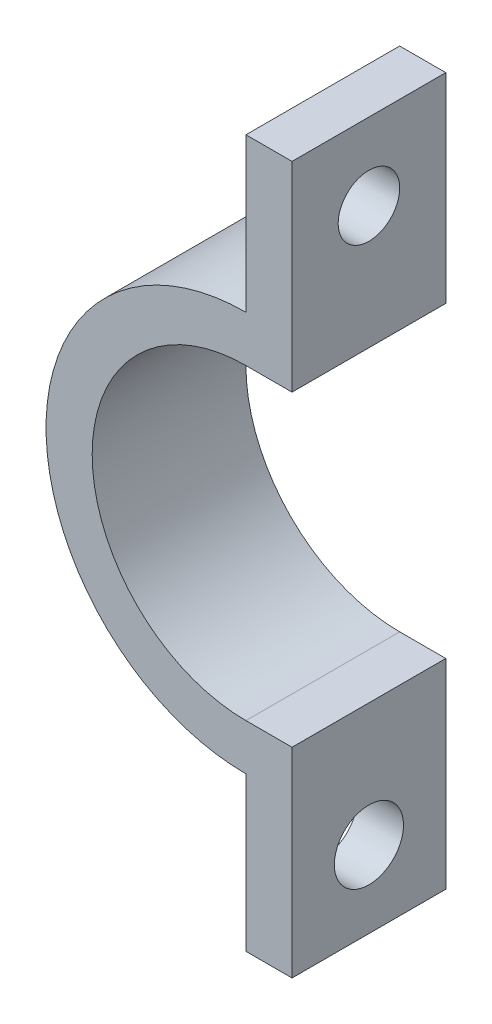
ISO-10303-21;
HEADER;
FILE_DESCRIPTION(('STEP AP214'),'2;1');
FILE_NAME('part.step','',(''),(''),'','','');
FILE_SCHEMA(('AUTOMOTIVE_DESIGN { 1 0 10303 214 1 1 1 1 }'));
ENDSEC;
DATA;
#1=APPLICATION_CONTEXT('core data for automotive mechanical design processes');
#2=APPLICATION_PROTOCOL_DEFINITION('international standard','automotive_design',2000,#1);
#3=PRODUCT_CONTEXT('',#1,'mechanical');
#4=PRODUCT('Part','Part','',(#3));
#5=PRODUCT_RELATED_PRODUCT_CATEGORY('part','',(#4));
#6=PRODUCT_DEFINITION_FORMATION('','',#4);
#7=PRODUCT_DEFINITION_CONTEXT('part definition',#1,'design');
#8=PRODUCT_DEFINITION('design','',#6,#7);
#9=PRODUCT_DEFINITION_SHAPE('','',#8);
#10=(LENGTH_UNIT() NAMED_UNIT(*) SI_UNIT(.MILLI.,.METRE.));
#11=(NAMED_UNIT(*) PLANE_ANGLE_UNIT() SI_UNIT($,.RADIAN.));
#12=(NAMED_UNIT(*) SI_UNIT($,.STERADIAN.) SOLID_ANGLE_UNIT());
#13=UNCERTAINTY_MEASURE_WITH_UNIT(LENGTH_MEASURE(1.E-05),#10,'distance_accuracy_value','');
#14=(GEOMETRIC_REPRESENTATION_CONTEXT(3) GLOBAL_UNCERTAINTY_ASSIGNED_CONTEXT((#13)) GLOBAL_UNIT_ASSIGNED_CONTEXT((#10,
#11,#12)) REPRESENTATION_CONTEXT('',''));
#15=CARTESIAN_POINT('',(0.,0.,0.));
#16=DIRECTION('',(0.,0.,1.));
#17=DIRECTION('',(1.,0.,0.));
#18=AXIS2_PLACEMENT_3D('',#15,#16,#17);
#19=CARTESIAN_POINT('',(0.,0.,10.));
#20=DIRECTION('',(0.,0.,-1.));
#21=DIRECTION('',(-1.,0.,0.));
#22=AXIS2_PLACEMENT_3D('',#19,#20,#21);
#23=CYLINDRICAL_SURFACE('',#22,10.);
#24=CARTESIAN_POINT('',(0.,0.,0.));
#25=DIRECTION('',(0.,0.,-1.));
#26=DIRECTION('',(1.,0.,0.));
#27=AXIS2_PLACEMENT_3D('',#24,#25,#26);
#28=CIRCLE('',#27,10.);
#29=CARTESIAN_POINT('',(0.,-10.,0.));
#30=VERTEX_POINT('',#29);
#31=CARTESIAN_POINT('',(0.,10.,0.));
#32=VERTEX_POINT('',#31);
#33=EDGE_CURVE('E142',#30,#32,#28,.T.);
#34=ORIENTED_EDGE('',*,*,#33,.T.);
#35=DIRECTION('',(0.,0.,-1.));
#36=VECTOR('',#35,1.);
#37=CARTESIAN_POINT('',(0.,10.,10.));
#38=LINE('',#37,#36);
#39=CARTESIAN_POINT('',(0.,10.,10.));
#40=VERTEX_POINT('',#39);
#41=EDGE_CURVE('E11',#40,#32,#38,.T.);
#42=ORIENTED_EDGE('',*,*,#41,.F.);
#43=CARTESIAN_POINT('',(0.,0.,10.));
#44=DIRECTION('',(0.,0.,-1.));
#45=DIRECTION('',(1.,0.,0.));
#46=AXIS2_PLACEMENT_3D('',#43,#44,#45);
#47=CIRCLE('',#46,10.);
#48=CARTESIAN_POINT('',(0.,-10.,10.));
#49=VERTEX_POINT('',#48);
#50=EDGE_CURVE('E161',#49,#40,#47,.T.);
#51=ORIENTED_EDGE('',*,*,#50,.F.);
#52=DIRECTION('',(0.,0.,-1.));
#53=VECTOR('',#52,1.);
#54=CARTESIAN_POINT('',(0.,-10.,10.));
#55=LINE('',#54,#53);
#56=EDGE_CURVE('E138',#49,#30,#55,.T.);
#57=ORIENTED_EDGE('',*,*,#56,.T.);
#58=EDGE_LOOP('',(#34,#42,#51,#57));
#59=FACE_BOUND('',#58,.T.);
#60=ADVANCED_FACE('F33',(#59),#23,.F.);
#61=CARTESIAN_POINT('',(3.,9.99999999999999,10.));
#62=DIRECTION('',(0.,1.,0.));
#63=DIRECTION('',(-1.,0.,0.));
#64=AXIS2_PLACEMENT_3D('',#61,#62,#63);
#65=PLANE('',#64);
#66=DIRECTION('',(1.,0.,0.));
#67=VECTOR('',#66,1.);
#68=CARTESIAN_POINT('',(3.,9.99999999999999,0.));
#69=LINE('',#68,#67);
#70=CARTESIAN_POINT('',(3.,9.99999999999999,0.));
#71=VERTEX_POINT('',#70);
#72=EDGE_CURVE('E145',#32,#71,#69,.T.);
#73=ORIENTED_EDGE('',*,*,#72,.T.);
#74=DIRECTION('',(0.,0.,-1.));
#75=VECTOR('',#74,1.);
#76=CARTESIAN_POINT('',(3.,9.99999999999999,10.));
#77=LINE('',#76,#75);
#78=CARTESIAN_POINT('',(3.,9.99999999999999,10.));
#79=VERTEX_POINT('',#78);
#80=EDGE_CURVE('E42',#79,#71,#77,.T.);
#81=ORIENTED_EDGE('',*,*,#80,.F.);
#82=DIRECTION('',(1.,0.,0.));
#83=VECTOR('',#82,1.);
#84=CARTESIAN_POINT('',(3.,9.99999999999999,10.));
#85=LINE('',#84,#83);
#86=EDGE_CURVE('E99',#40,#79,#85,.T.);
#87=ORIENTED_EDGE('',*,*,#86,.F.);
#88=ORIENTED_EDGE('',*,*,#41,.T.);
#89=EDGE_LOOP('',(#73,#81,#87,#88));
#90=FACE_BOUND('',#89,.T.);
#91=ADVANCED_FACE('F232',(#90),#65,.F.);
#92=CARTESIAN_POINT('',(3.,23.,10.));
#93=DIRECTION('',(-1.,0.,0.));
#94=DIRECTION('',(0.,-1.,0.));
#95=AXIS2_PLACEMENT_3D('',#92,#93,#94);
#96=PLANE('',#95);
#97=CARTESIAN_POINT('',(3.,18.,5.));
#98=DIRECTION('',(-1.,0.,0.));
#99=DIRECTION('',(0.,0.,1.));
#100=AXIS2_PLACEMENT_3D('',#97,#98,#99);
#101=CIRCLE('',#100,2.);
#102=CARTESIAN_POINT('',(3.,18.,7.));
#103=VERTEX_POINT('',#102);
#104=EDGE_CURVE('E146',#103,#103,#101,.T.);
#105=ORIENTED_EDGE('',*,*,#104,.T.);
#106=EDGE_LOOP('',(#105));
#107=FACE_BOUND('',#106,.T.);
#108=DIRECTION('',(0.,1.,0.));
#109=VECTOR('',#108,1.);
#110=CARTESIAN_POINT('',(3.,23.,0.));
#111=LINE('',#110,#109);
#112=CARTESIAN_POINT('',(3.,23.,0.));
#113=VERTEX_POINT('',#112);
#114=EDGE_CURVE('E148',#71,#113,#111,.T.);
#115=ORIENTED_EDGE('',*,*,#114,.T.);
#116=DIRECTION('',(0.,0.,-1.));
#117=VECTOR('',#116,1.);
#118=CARTESIAN_POINT('',(3.,23.,10.));
#119=LINE('',#118,#117);
#120=CARTESIAN_POINT('',(3.,23.,10.));
#121=VERTEX_POINT('',#120);
#122=EDGE_CURVE('E174',#121,#113,#119,.T.);
#123=ORIENTED_EDGE('',*,*,#122,.F.);
#124=DIRECTION('',(0.,1.,0.));
#125=VECTOR('',#124,1.);
#126=CARTESIAN_POINT('',(3.,23.,10.));
#127=LINE('',#126,#125);
#128=EDGE_CURVE('E183',#79,#121,#127,.T.);
#129=ORIENTED_EDGE('',*,*,#128,.F.);
#130=ORIENTED_EDGE('',*,*,#80,.T.);
#131=EDGE_LOOP('',(#115,#123,#129,#130));
#132=FACE_BOUND('',#131,.T.);
#133=ADVANCED_FACE('F181',(#107,#132),#96,.F.);
#134=CARTESIAN_POINT('',(0.,23.,10.));
#135=DIRECTION('',(0.,-1.,0.));
#136=DIRECTION('',(1.,0.,0.));
#137=AXIS2_PLACEMENT_3D('',#134,#135,#136);
#138=PLANE('',#137);
#139=DIRECTION('',(-1.,0.,0.));
#140=VECTOR('',#139,1.);
#141=CARTESIAN_POINT('',(0.,23.,0.));
#142=LINE('',#141,#140);
#143=CARTESIAN_POINT('',(0.,23.,0.));
#144=VERTEX_POINT('',#143);
#145=EDGE_CURVE('E150',#113,#144,#142,.T.);
#146=ORIENTED_EDGE('',*,*,#145,.T.);
#147=DIRECTION('',(0.,0.,-1.));
#148=VECTOR('',#147,1.);
#149=CARTESIAN_POINT('',(0.,23.,10.));
#150=LINE('',#149,#148);
#151=CARTESIAN_POINT('',(0.,23.,10.));
#152=VERTEX_POINT('',#151);
#153=EDGE_CURVE('E171',#152,#144,#150,.T.);
#154=ORIENTED_EDGE('',*,*,#153,.F.);
#155=DIRECTION('',(-1.,0.,0.));
#156=VECTOR('',#155,1.);
#157=CARTESIAN_POINT('',(0.,23.,10.));
#158=LINE('',#157,#156);
#159=EDGE_CURVE('E201',#121,#152,#158,.T.);
#160=ORIENTED_EDGE('',*,*,#159,.F.);
#161=ORIENTED_EDGE('',*,*,#122,.T.);
#162=EDGE_LOOP('',(#146,#154,#160,#161));
#163=FACE_BOUND('',#162,.T.);
#164=ADVANCED_FACE('F192',(#163),#138,.F.);
#165=CARTESIAN_POINT('',(0.,13.,10.));
#166=DIRECTION('',(1.,0.,0.));
#167=DIRECTION('',(0.,0.,-1.));
#168=AXIS2_PLACEMENT_3D('',#165,#166,#167);
#169=PLANE('',#168);
#170=CARTESIAN_POINT('',(0.,18.,5.));
#171=DIRECTION('',(-1.,0.,0.));
#172=DIRECTION('',(0.,0.,1.));
#173=AXIS2_PLACEMENT_3D('',#170,#171,#172);
#174=CIRCLE('',#173,2.);
#175=CARTESIAN_POINT('',(0.,18.,7.));
#176=VERTEX_POINT('',#175);
#177=EDGE_CURVE('E209',#176,#176,#174,.T.);
#178=ORIENTED_EDGE('',*,*,#177,.F.);
#179=EDGE_LOOP('',(#178));
#180=FACE_BOUND('',#179,.T.);
#181=DIRECTION('',(0.,-1.,0.));
#182=VECTOR('',#181,1.);
#183=CARTESIAN_POINT('',(0.,13.,0.));
#184=LINE('',#183,#182);
#185=CARTESIAN_POINT('',(0.,13.,0.));
#186=VERTEX_POINT('',#185);
#187=EDGE_CURVE('E152',#144,#186,#184,.T.);
#188=ORIENTED_EDGE('',*,*,#187,.T.);
#189=DIRECTION('',(0.,0.,-1.));
#190=VECTOR('',#189,1.);
#191=CARTESIAN_POINT('',(0.,13.,10.));
#192=LINE('',#191,#190);
#193=CARTESIAN_POINT('',(0.,13.,10.));
#194=VERTEX_POINT('',#193);
#195=EDGE_CURVE('E168',#194,#186,#192,.T.);
#196=ORIENTED_EDGE('',*,*,#195,.F.);
#197=DIRECTION('',(0.,-1.,0.));
#198=VECTOR('',#197,1.);
#199=CARTESIAN_POINT('',(0.,13.,10.));
#200=LINE('',#199,#198);
#201=EDGE_CURVE('E198',#152,#194,#200,.T.);
#202=ORIENTED_EDGE('',*,*,#201,.F.);
#203=ORIENTED_EDGE('',*,*,#153,.T.);
#204=EDGE_LOOP('',(#188,#196,#202,#203));
#205=FACE_BOUND('',#204,.T.);
#206=ADVANCED_FACE('F196',(#180,#205),#169,.F.);
#207=CARTESIAN_POINT('',(0.,0.,10.));
#208=DIRECTION('',(0.,0.,-1.));
#209=DIRECTION('',(-1.,0.,0.));
#210=AXIS2_PLACEMENT_3D('',#207,#208,#209);
#211=CYLINDRICAL_SURFACE('',#210,13.);
#212=CARTESIAN_POINT('',(0.,0.,0.));
#213=DIRECTION('',(0.,0.,1.));
#214=DIRECTION('',(1.,0.,0.));
#215=AXIS2_PLACEMENT_3D('',#212,#213,#214);
#216=CIRCLE('',#215,13.);
#217=CARTESIAN_POINT('',(0.,-13.,0.));
#218=VERTEX_POINT('',#217);
#219=EDGE_CURVE('E154',#186,#218,#216,.T.);
#220=ORIENTED_EDGE('',*,*,#219,.T.);
#221=DIRECTION('',(0.,0.,-1.));
#222=VECTOR('',#221,1.);
#223=CARTESIAN_POINT('',(0.,-13.,10.));
#224=LINE('',#223,#222);
#225=CARTESIAN_POINT('',(0.,-13.,10.));
#226=VERTEX_POINT('',#225);
#227=EDGE_CURVE('E165',#226,#218,#224,.T.);
#228=ORIENTED_EDGE('',*,*,#227,.F.);
#229=CARTESIAN_POINT('',(0.,0.,10.));
#230=DIRECTION('',(0.,0.,1.));
#231=DIRECTION('',(1.,0.,0.));
#232=AXIS2_PLACEMENT_3D('',#229,#230,#231);
#233=CIRCLE('',#232,13.);
#234=EDGE_CURVE('E200',#194,#226,#233,.T.);
#235=ORIENTED_EDGE('',*,*,#234,.F.);
#236=ORIENTED_EDGE('',*,*,#195,.T.);
#237=EDGE_LOOP('',(#220,#228,#235,#236));
#238=FACE_BOUND('',#237,.T.);
#239=ADVANCED_FACE('F244',(#238),#211,.T.);
#240=CARTESIAN_POINT('',(0.,-13.,10.));
#241=DIRECTION('',(1.,0.,0.));
#242=DIRECTION('',(0.,0.,-1.));
#243=AXIS2_PLACEMENT_3D('',#240,#241,#242);
#244=PLANE('',#243);
#245=CARTESIAN_POINT('',(0.,-18.,5.));
#246=DIRECTION('',(-1.,0.,0.));
#247=DIRECTION('',(0.,0.,1.));
#248=AXIS2_PLACEMENT_3D('',#245,#246,#247);
#249=CIRCLE('',#248,2.25);
#250=CARTESIAN_POINT('',(0.,-18.,7.25));
#251=VERTEX_POINT('',#250);
#252=EDGE_CURVE('E214',#251,#251,#249,.T.);
#253=ORIENTED_EDGE('',*,*,#252,.F.);
#254=EDGE_LOOP('',(#253));
#255=FACE_BOUND('',#254,.T.);
#256=DIRECTION('',(0.,-1.,0.));
#257=VECTOR('',#256,1.);
#258=CARTESIAN_POINT('',(0.,-13.,0.));
#259=LINE('',#258,#257);
#260=CARTESIAN_POINT('',(0.,-23.,0.));
#261=VERTEX_POINT('',#260);
#262=EDGE_CURVE('E156',#218,#261,#259,.T.);
#263=ORIENTED_EDGE('',*,*,#262,.T.);
#264=DIRECTION('',(0.,0.,-1.));
#265=VECTOR('',#264,1.);
#266=CARTESIAN_POINT('',(0.,-23.,10.));
#267=LINE('',#266,#265);
#268=CARTESIAN_POINT('',(0.,-23.,10.));
#269=VERTEX_POINT('',#268);
#270=EDGE_CURVE('E133',#269,#261,#267,.T.);
#271=ORIENTED_EDGE('',*,*,#270,.F.);
#272=DIRECTION('',(0.,-1.,0.));
#273=VECTOR('',#272,1.);
#274=CARTESIAN_POINT('',(0.,-13.,10.));
#275=LINE('',#274,#273);
#276=EDGE_CURVE('E124',#226,#269,#275,.T.);
#277=ORIENTED_EDGE('',*,*,#276,.F.);
#278=ORIENTED_EDGE('',*,*,#227,.T.);
#279=EDGE_LOOP('',(#263,#271,#277,#278));
#280=FACE_BOUND('',#279,.T.);
#281=ADVANCED_FACE('F241',(#255,#280),#244,.F.);
#282=CARTESIAN_POINT('',(0.,-23.,10.));
#283=DIRECTION('',(0.,1.,0.));
#284=DIRECTION('',(-1.,0.,0.));
#285=AXIS2_PLACEMENT_3D('',#282,#283,#284);
#286=PLANE('',#285);
#287=DIRECTION('',(1.,0.,0.));
#288=VECTOR('',#287,1.);
#289=CARTESIAN_POINT('',(0.,-23.,0.));
#290=LINE('',#289,#288);
#291=CARTESIAN_POINT('',(3.,-23.,0.));
#292=VERTEX_POINT('',#291);
#293=EDGE_CURVE('E132',#261,#292,#290,.T.);
#294=ORIENTED_EDGE('',*,*,#293,.T.);
#295=DIRECTION('',(0.,0.,-1.));
#296=VECTOR('',#295,1.);
#297=CARTESIAN_POINT('',(3.,-23.,10.));
#298=LINE('',#297,#296);
#299=CARTESIAN_POINT('',(3.,-23.,10.));
#300=VERTEX_POINT('',#299);
#301=EDGE_CURVE('E129',#300,#292,#298,.T.);
#302=ORIENTED_EDGE('',*,*,#301,.F.);
#303=DIRECTION('',(1.,0.,0.));
#304=VECTOR('',#303,1.);
#305=CARTESIAN_POINT('',(0.,-23.,10.));
#306=LINE('',#305,#304);
#307=EDGE_CURVE('E118',#269,#300,#306,.T.);
#308=ORIENTED_EDGE('',*,*,#307,.F.);
#309=ORIENTED_EDGE('',*,*,#270,.T.);
#310=EDGE_LOOP('',(#294,#302,#308,#309));
#311=FACE_BOUND('',#310,.T.);
#312=ADVANCED_FACE('F130',(#311),#286,.F.);
#313=CARTESIAN_POINT('',(3.,-23.,10.));
#314=DIRECTION('',(-1.,0.,0.));
#315=DIRECTION('',(0.,-1.,0.));
#316=AXIS2_PLACEMENT_3D('',#313,#314,#315);
#317=PLANE('',#316);
#318=CARTESIAN_POINT('',(3.,-18.,5.));
#319=DIRECTION('',(-1.,0.,0.));
#320=DIRECTION('',(0.,-1.,0.));
#321=AXIS2_PLACEMENT_3D('',#318,#319,#320);
#322=CIRCLE('',#321,2.25);
#323=CARTESIAN_POINT('',(3.,-20.25,5.));
#324=VERTEX_POINT('',#323);
#325=EDGE_CURVE('E36',#324,#324,#322,.T.);
#326=ORIENTED_EDGE('',*,*,#325,.T.);
#327=EDGE_LOOP('',(#326));
#328=FACE_BOUND('',#327,.T.);
#329=DIRECTION('',(0.,1.,0.));
#330=VECTOR('',#329,1.);
#331=CARTESIAN_POINT('',(3.,-23.,0.));
#332=LINE('',#331,#330);
#333=CARTESIAN_POINT('',(3.,-9.99999999999999,0.));
#334=VERTEX_POINT('',#333);
#335=EDGE_CURVE('E85',#292,#334,#332,.T.);
#336=ORIENTED_EDGE('',*,*,#335,.T.);
#337=DIRECTION('',(0.,0.,-1.));
#338=VECTOR('',#337,1.);
#339=CARTESIAN_POINT('',(3.,-9.99999999999999,10.));
#340=LINE('',#339,#338);
#341=CARTESIAN_POINT('',(3.,-9.99999999999999,10.));
#342=VERTEX_POINT('',#341);
#343=EDGE_CURVE('E134',#342,#334,#340,.T.);
#344=ORIENTED_EDGE('',*,*,#343,.F.);
#345=DIRECTION('',(0.,1.,0.));
#346=VECTOR('',#345,1.);
#347=CARTESIAN_POINT('',(3.,-23.,10.));
#348=LINE('',#347,#346);
#349=EDGE_CURVE('E122',#300,#342,#348,.T.);
#350=ORIENTED_EDGE('',*,*,#349,.F.);
#351=ORIENTED_EDGE('',*,*,#301,.T.);
#352=EDGE_LOOP('',(#336,#344,#350,#351));
#353=FACE_BOUND('',#352,.T.);
#354=ADVANCED_FACE('F136',(#328,#353),#317,.F.);
#355=CARTESIAN_POINT('',(3.,-9.99999999999999,10.));
#356=DIRECTION('',(0.,-1.,0.));
#357=DIRECTION('',(1.,0.,0.));
#358=AXIS2_PLACEMENT_3D('',#355,#356,#357);
#359=PLANE('',#358);
#360=DIRECTION('',(-1.,0.,0.));
#361=VECTOR('',#360,1.);
#362=CARTESIAN_POINT('',(3.,-9.99999999999999,0.));
#363=LINE('',#362,#361);
#364=EDGE_CURVE('E91',#334,#30,#363,.T.);
#365=ORIENTED_EDGE('',*,*,#364,.T.);
#366=ORIENTED_EDGE('',*,*,#56,.F.);
#367=DIRECTION('',(-1.,0.,0.));
#368=VECTOR('',#367,1.);
#369=CARTESIAN_POINT('',(3.,-9.99999999999999,10.));
#370=LINE('',#369,#368);
#371=EDGE_CURVE('E50',#342,#49,#370,.T.);
#372=ORIENTED_EDGE('',*,*,#371,.F.);
#373=ORIENTED_EDGE('',*,*,#343,.T.);
#374=EDGE_LOOP('',(#365,#366,#372,#373));
#375=FACE_BOUND('',#374,.T.);
#376=ADVANCED_FACE('F292',(#375),#359,.F.);
#377=CARTESIAN_POINT('',(0.,0.,10.));
#378=DIRECTION('',(0.,0.,1.));
#379=DIRECTION('',(1.,0.,0.));
#380=AXIS2_PLACEMENT_3D('',#377,#378,#379);
#381=PLANE('',#380);
#382=ORIENTED_EDGE('',*,*,#50,.T.);
#383=ORIENTED_EDGE('',*,*,#86,.T.);
#384=ORIENTED_EDGE('',*,*,#128,.T.);
#385=ORIENTED_EDGE('',*,*,#159,.T.);
#386=ORIENTED_EDGE('',*,*,#201,.T.);
#387=ORIENTED_EDGE('',*,*,#234,.T.);
#388=ORIENTED_EDGE('',*,*,#276,.T.);
#389=ORIENTED_EDGE('',*,*,#307,.T.);
#390=ORIENTED_EDGE('',*,*,#349,.T.);
#391=ORIENTED_EDGE('',*,*,#371,.T.);
#392=EDGE_LOOP('',(#382,#383,#384,#385,#386,#387,#388,#389,#390,#391));
#393=FACE_BOUND('',#392,.T.);
#394=ADVANCED_FACE('F120',(#393),#381,.T.);
#395=CARTESIAN_POINT('',(0.,0.,0.));
#396=DIRECTION('',(0.,0.,1.));
#397=DIRECTION('',(1.,0.,0.));
#398=AXIS2_PLACEMENT_3D('',#395,#396,#397);
#399=PLANE('',#398);
#400=ORIENTED_EDGE('',*,*,#33,.F.);
#401=ORIENTED_EDGE('',*,*,#364,.F.);
#402=ORIENTED_EDGE('',*,*,#335,.F.);
#403=ORIENTED_EDGE('',*,*,#293,.F.);
#404=ORIENTED_EDGE('',*,*,#262,.F.);
#405=ORIENTED_EDGE('',*,*,#219,.F.);
#406=ORIENTED_EDGE('',*,*,#187,.F.);
#407=ORIENTED_EDGE('',*,*,#145,.F.);
#408=ORIENTED_EDGE('',*,*,#114,.F.);
#409=ORIENTED_EDGE('',*,*,#72,.F.);
#410=EDGE_LOOP('',(#400,#401,#402,#403,#404,#405,#406,#407,#408,#409));
#411=FACE_BOUND('',#410,.T.);
#412=ADVANCED_FACE('F187',(#411),#399,.F.);
#413=CARTESIAN_POINT('',(3.,18.,5.));
#414=DIRECTION('',(-1.,0.,0.));
#415=DIRECTION('',(0.,0.,1.));
#416=AXIS2_PLACEMENT_3D('',#413,#414,#415);
#417=CYLINDRICAL_SURFACE('',#416,2.);
#418=ORIENTED_EDGE('',*,*,#104,.F.);
#419=EDGE_LOOP('',(#418));
#420=FACE_BOUND('',#419,.T.);
#421=ORIENTED_EDGE('',*,*,#177,.T.);
#422=EDGE_LOOP('',(#421));
#423=FACE_BOUND('',#422,.T.);
#424=ADVANCED_FACE('F224',(#420,#423),#417,.F.);
#425=CARTESIAN_POINT('',(3.2,-18.,5.));
#426=DIRECTION('',(-1.,0.,0.));
#427=DIRECTION('',(0.,0.,1.));
#428=AXIS2_PLACEMENT_3D('',#425,#426,#427);
#429=CYLINDRICAL_SURFACE('',#428,2.25);
#430=ORIENTED_EDGE('',*,*,#252,.T.);
#431=EDGE_LOOP('',(#430));
#432=FACE_BOUND('',#431,.T.);
#433=ORIENTED_EDGE('',*,*,#325,.F.);
#434=EDGE_LOOP('',(#433));
#435=FACE_BOUND('',#434,.T.);
#436=ADVANCED_FACE('F222',(#432,#435),#429,.F.);
#437=CLOSED_SHELL('',(#60,#91,#133,#164,#206,#239,#281,#312,#354,#376,#394,#412,#424,#436));
#438=MANIFOLD_SOLID_BREP('B2',#437);
#439=ADVANCED_BREP_SHAPE_REPRESENTATION('',(#18,#438),#14);
#440=SHAPE_DEFINITION_REPRESENTATION(#9,#439);
ENDSEC;
END-ISO-10303-21;
